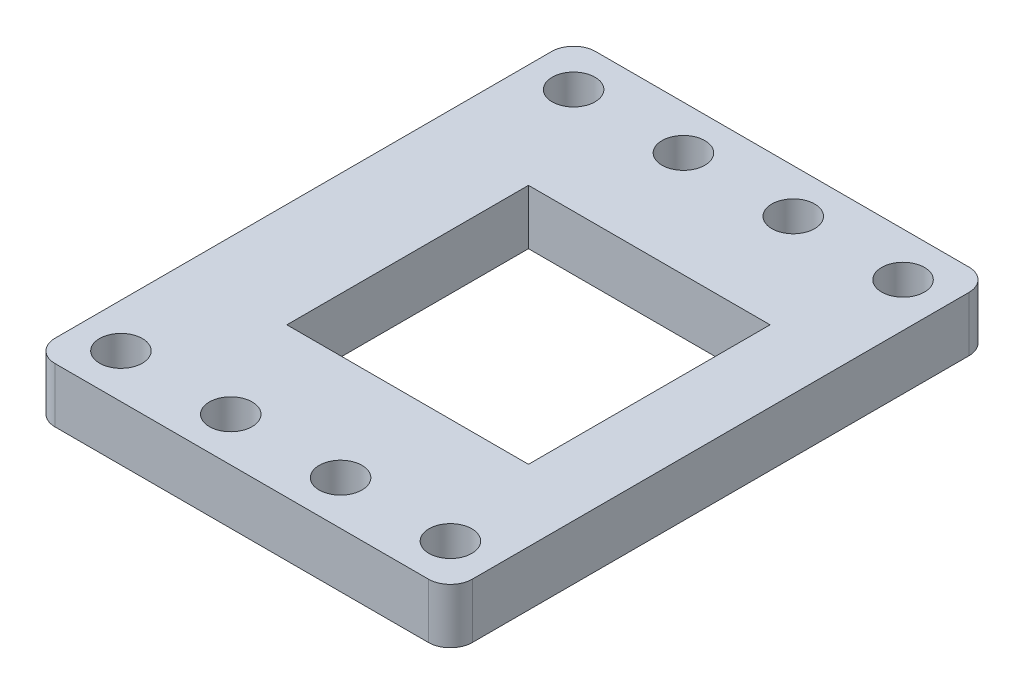
ISO-10303-21;
HEADER;
FILE_DESCRIPTION(('STEP AP214'),'2;1');
FILE_NAME('part.step','',(''),(''),'','','');
FILE_SCHEMA(('AUTOMOTIVE_DESIGN { 1 0 10303 214 1 1 1 1 }'));
ENDSEC;
DATA;
#1=APPLICATION_CONTEXT('core data for automotive mechanical design processes');
#2=APPLICATION_PROTOCOL_DEFINITION('international standard','automotive_design',2000,#1);
#3=PRODUCT_CONTEXT('',#1,'mechanical');
#4=PRODUCT('Part','Part','',(#3));
#5=PRODUCT_RELATED_PRODUCT_CATEGORY('part','',(#4));
#6=PRODUCT_DEFINITION_FORMATION('','',#4);
#7=PRODUCT_DEFINITION_CONTEXT('part definition',#1,'design');
#8=PRODUCT_DEFINITION('design','',#6,#7);
#9=PRODUCT_DEFINITION_SHAPE('','',#8);
#10=(LENGTH_UNIT() NAMED_UNIT(*) SI_UNIT(.MILLI.,.METRE.));
#11=(NAMED_UNIT(*) PLANE_ANGLE_UNIT() SI_UNIT($,.RADIAN.));
#12=(NAMED_UNIT(*) SI_UNIT($,.STERADIAN.) SOLID_ANGLE_UNIT());
#13=UNCERTAINTY_MEASURE_WITH_UNIT(LENGTH_MEASURE(1.E-05),#10,'distance_accuracy_value','');
#14=(GEOMETRIC_REPRESENTATION_CONTEXT(3) GLOBAL_UNCERTAINTY_ASSIGNED_CONTEXT((#13)) GLOBAL_UNIT_ASSIGNED_CONTEXT((#10,
#11,#12)) REPRESENTATION_CONTEXT('',''));
#15=CARTESIAN_POINT('',(0.,0.,0.));
#16=DIRECTION('',(0.,0.,1.));
#17=DIRECTION('',(1.,0.,0.));
#18=AXIS2_PLACEMENT_3D('',#15,#16,#17);
#19=CARTESIAN_POINT('',(-1.99999999999999,5.,47.22));
#20=DIRECTION('',(0.,-1.,0.));
#21=DIRECTION('',(0.,0.,-1.));
#22=AXIS2_PLACEMENT_3D('',#19,#20,#21);
#23=CYLINDRICAL_SURFACE('',#22,2.);
#24=CARTESIAN_POINT('',(-1.99999999999999,0.,47.22));
#25=DIRECTION('',(0.,1.,0.));
#26=DIRECTION('',(0.,0.,1.));
#27=AXIS2_PLACEMENT_3D('',#24,#25,#26);
#28=CIRCLE('',#27,2.);
#29=CARTESIAN_POINT('',(-1.99999999999999,0.,49.22));
#30=VERTEX_POINT('',#29);
#31=CARTESIAN_POINT('',(0.,0.,47.22));
#32=VERTEX_POINT('',#31);
#33=EDGE_CURVE('E201',#30,#32,#28,.T.);
#34=ORIENTED_EDGE('',*,*,#33,.T.);
#35=DIRECTION('',(0.,-1.,0.));
#36=VECTOR('',#35,1.);
#37=CARTESIAN_POINT('',(0.,5.,47.22));
#38=LINE('',#37,#36);
#39=CARTESIAN_POINT('',(0.,5.,47.22));
#40=VERTEX_POINT('',#39);
#41=EDGE_CURVE('E11',#40,#32,#38,.T.);
#42=ORIENTED_EDGE('',*,*,#41,.F.);
#43=CARTESIAN_POINT('',(-1.99999999999999,5.,47.22));
#44=DIRECTION('',(0.,1.,0.));
#45=DIRECTION('',(0.,0.,1.));
#46=AXIS2_PLACEMENT_3D('',#43,#44,#45);
#47=CIRCLE('',#46,2.);
#48=CARTESIAN_POINT('',(-1.99999999999999,5.,49.22));
#49=VERTEX_POINT('',#48);
#50=EDGE_CURVE('E204',#49,#40,#47,.T.);
#51=ORIENTED_EDGE('',*,*,#50,.F.);
#52=DIRECTION('',(0.,-1.,0.));
#53=VECTOR('',#52,1.);
#54=CARTESIAN_POINT('',(-1.99999999999999,5.,49.22));
#55=LINE('',#54,#53);
#56=EDGE_CURVE('E222',#49,#30,#55,.T.);
#57=ORIENTED_EDGE('',*,*,#56,.T.);
#58=EDGE_LOOP('',(#34,#42,#51,#57));
#59=FACE_BOUND('',#58,.T.);
#60=ADVANCED_FACE('F33',(#59),#23,.T.);
#61=CARTESIAN_POINT('',(0.,5.,2.));
#62=DIRECTION('',(-1.,0.,0.));
#63=DIRECTION('',(0.,0.,1.));
#64=AXIS2_PLACEMENT_3D('',#61,#62,#63);
#65=PLANE('',#64);
#66=DIRECTION('',(0.,0.,-1.));
#67=VECTOR('',#66,1.);
#68=CARTESIAN_POINT('',(0.,0.,2.));
#69=LINE('',#68,#67);
#70=CARTESIAN_POINT('',(0.,0.,2.));
#71=VERTEX_POINT('',#70);
#72=EDGE_CURVE('E225',#32,#71,#69,.T.);
#73=ORIENTED_EDGE('',*,*,#72,.T.);
#74=DIRECTION('',(0.,-1.,0.));
#75=VECTOR('',#74,1.);
#76=CARTESIAN_POINT('',(0.,5.,2.));
#77=LINE('',#76,#75);
#78=CARTESIAN_POINT('',(0.,5.,2.));
#79=VERTEX_POINT('',#78);
#80=EDGE_CURVE('E40',#79,#71,#77,.T.);
#81=ORIENTED_EDGE('',*,*,#80,.F.);
#82=DIRECTION('',(0.,0.,-1.));
#83=VECTOR('',#82,1.);
#84=CARTESIAN_POINT('',(0.,5.,2.));
#85=LINE('',#84,#83);
#86=EDGE_CURVE('E207',#40,#79,#85,.T.);
#87=ORIENTED_EDGE('',*,*,#86,.F.);
#88=ORIENTED_EDGE('',*,*,#41,.T.);
#89=EDGE_LOOP('',(#73,#81,#87,#88));
#90=FACE_BOUND('',#89,.T.);
#91=ADVANCED_FACE('F281',(#90),#65,.F.);
#92=CARTESIAN_POINT('',(-2.,5.,2.));
#93=DIRECTION('',(0.,-1.,0.));
#94=DIRECTION('',(0.,0.,-1.));
#95=AXIS2_PLACEMENT_3D('',#92,#93,#94);
#96=CYLINDRICAL_SURFACE('',#95,2.);
#97=CARTESIAN_POINT('',(-2.,0.,2.));
#98=DIRECTION('',(0.,1.,0.));
#99=DIRECTION('',(0.,0.,-1.));
#100=AXIS2_PLACEMENT_3D('',#97,#98,#99);
#101=CIRCLE('',#100,2.);
#102=CARTESIAN_POINT('',(-2.,0.,0.));
#103=VERTEX_POINT('',#102);
#104=EDGE_CURVE('E227',#71,#103,#101,.T.);
#105=ORIENTED_EDGE('',*,*,#104,.T.);
#106=DIRECTION('',(0.,-1.,0.));
#107=VECTOR('',#106,1.);
#108=CARTESIAN_POINT('',(-2.,5.,0.));
#109=LINE('',#108,#107);
#110=CARTESIAN_POINT('',(-2.,5.,0.));
#111=VERTEX_POINT('',#110);
#112=EDGE_CURVE('E252',#111,#103,#109,.T.);
#113=ORIENTED_EDGE('',*,*,#112,.F.);
#114=CARTESIAN_POINT('',(-2.,5.,2.));
#115=DIRECTION('',(0.,1.,0.));
#116=DIRECTION('',(0.,0.,-1.));
#117=AXIS2_PLACEMENT_3D('',#114,#115,#116);
#118=CIRCLE('',#117,2.);
#119=EDGE_CURVE('E210',#79,#111,#118,.T.);
#120=ORIENTED_EDGE('',*,*,#119,.F.);
#121=ORIENTED_EDGE('',*,*,#80,.T.);
#122=EDGE_LOOP('',(#105,#113,#120,#121));
#123=FACE_BOUND('',#122,.T.);
#124=ADVANCED_FACE('F259',(#123),#96,.T.);
#125=CARTESIAN_POINT('',(-36.,5.,0.));
#126=DIRECTION('',(0.,0.,1.));
#127=DIRECTION('',(1.,0.,0.));
#128=AXIS2_PLACEMENT_3D('',#125,#126,#127);
#129=PLANE('',#128);
#130=DIRECTION('',(-1.,0.,0.));
#131=VECTOR('',#130,1.);
#132=CARTESIAN_POINT('',(-36.,0.,0.));
#133=LINE('',#132,#131);
#134=CARTESIAN_POINT('',(-36.,0.,0.));
#135=VERTEX_POINT('',#134);
#136=EDGE_CURVE('E229',#103,#135,#133,.T.);
#137=ORIENTED_EDGE('',*,*,#136,.T.);
#138=DIRECTION('',(0.,-1.,0.));
#139=VECTOR('',#138,1.);
#140=CARTESIAN_POINT('',(-36.,5.,0.));
#141=LINE('',#140,#139);
#142=CARTESIAN_POINT('',(-36.,5.,0.));
#143=VERTEX_POINT('',#142);
#144=EDGE_CURVE('E249',#143,#135,#141,.T.);
#145=ORIENTED_EDGE('',*,*,#144,.F.);
#146=DIRECTION('',(-1.,0.,0.));
#147=VECTOR('',#146,1.);
#148=CARTESIAN_POINT('',(-36.,5.,0.));
#149=LINE('',#148,#147);
#150=EDGE_CURVE('E212',#111,#143,#149,.T.);
#151=ORIENTED_EDGE('',*,*,#150,.F.);
#152=ORIENTED_EDGE('',*,*,#112,.T.);
#153=EDGE_LOOP('',(#137,#145,#151,#152));
#154=FACE_BOUND('',#153,.T.);
#155=ADVANCED_FACE('F269',(#154),#129,.F.);
#156=CARTESIAN_POINT('',(-36.,5.,2.));
#157=DIRECTION('',(0.,-1.,0.));
#158=DIRECTION('',(0.,0.,-1.));
#159=AXIS2_PLACEMENT_3D('',#156,#157,#158);
#160=CYLINDRICAL_SURFACE('',#159,2.);
#161=CARTESIAN_POINT('',(-36.,0.,2.));
#162=DIRECTION('',(0.,1.,0.));
#163=DIRECTION('',(0.,0.,1.));
#164=AXIS2_PLACEMENT_3D('',#161,#162,#163);
#165=CIRCLE('',#164,2.);
#166=CARTESIAN_POINT('',(-38.,0.,2.));
#167=VERTEX_POINT('',#166);
#168=EDGE_CURVE('E231',#135,#167,#165,.T.);
#169=ORIENTED_EDGE('',*,*,#168,.T.);
#170=DIRECTION('',(0.,-1.,0.));
#171=VECTOR('',#170,1.);
#172=CARTESIAN_POINT('',(-38.,5.,2.));
#173=LINE('',#172,#171);
#174=CARTESIAN_POINT('',(-38.,5.,2.));
#175=VERTEX_POINT('',#174);
#176=EDGE_CURVE('E246',#175,#167,#173,.T.);
#177=ORIENTED_EDGE('',*,*,#176,.F.);
#178=CARTESIAN_POINT('',(-36.,5.,2.));
#179=DIRECTION('',(0.,1.,0.));
#180=DIRECTION('',(0.,0.,1.));
#181=AXIS2_PLACEMENT_3D('',#178,#179,#180);
#182=CIRCLE('',#181,2.);
#183=EDGE_CURVE('E214',#143,#175,#182,.T.);
#184=ORIENTED_EDGE('',*,*,#183,.F.);
#185=ORIENTED_EDGE('',*,*,#144,.T.);
#186=EDGE_LOOP('',(#169,#177,#184,#185));
#187=FACE_BOUND('',#186,.T.);
#188=ADVANCED_FACE('F273',(#187),#160,.T.);
#189=CARTESIAN_POINT('',(-38.,5.,2.));
#190=DIRECTION('',(1.,0.,0.));
#191=DIRECTION('',(0.,0.,-1.));
#192=AXIS2_PLACEMENT_3D('',#189,#190,#191);
#193=PLANE('',#192);
#194=DIRECTION('',(0.,0.,1.));
#195=VECTOR('',#194,1.);
#196=CARTESIAN_POINT('',(-38.,0.,2.));
#197=LINE('',#196,#195);
#198=CARTESIAN_POINT('',(-38.,0.,47.22));
#199=VERTEX_POINT('',#198);
#200=EDGE_CURVE('E233',#167,#199,#197,.T.);
#201=ORIENTED_EDGE('',*,*,#200,.T.);
#202=DIRECTION('',(0.,-1.,0.));
#203=VECTOR('',#202,1.);
#204=CARTESIAN_POINT('',(-38.,5.,47.22));
#205=LINE('',#204,#203);
#206=CARTESIAN_POINT('',(-38.,5.,47.22));
#207=VERTEX_POINT('',#206);
#208=EDGE_CURVE('E243',#207,#199,#205,.T.);
#209=ORIENTED_EDGE('',*,*,#208,.F.);
#210=DIRECTION('',(0.,0.,1.));
#211=VECTOR('',#210,1.);
#212=CARTESIAN_POINT('',(-38.,5.,2.));
#213=LINE('',#212,#211);
#214=EDGE_CURVE('E216',#175,#207,#213,.T.);
#215=ORIENTED_EDGE('',*,*,#214,.F.);
#216=ORIENTED_EDGE('',*,*,#176,.T.);
#217=EDGE_LOOP('',(#201,#209,#215,#216));
#218=FACE_BOUND('',#217,.T.);
#219=ADVANCED_FACE('F294',(#218),#193,.F.);
#220=CARTESIAN_POINT('',(-36.,5.,47.22));
#221=DIRECTION('',(0.,-1.,0.));
#222=DIRECTION('',(0.,0.,-1.));
#223=AXIS2_PLACEMENT_3D('',#220,#221,#222);
#224=CYLINDRICAL_SURFACE('',#223,2.);
#225=CARTESIAN_POINT('',(-36.,0.,47.22));
#226=DIRECTION('',(0.,1.,0.));
#227=DIRECTION('',(0.,0.,1.));
#228=AXIS2_PLACEMENT_3D('',#225,#226,#227);
#229=CIRCLE('',#228,2.);
#230=CARTESIAN_POINT('',(-36.,0.,49.22));
#231=VERTEX_POINT('',#230);
#232=EDGE_CURVE('E235',#199,#231,#229,.T.);
#233=ORIENTED_EDGE('',*,*,#232,.T.);
#234=DIRECTION('',(0.,-1.,0.));
#235=VECTOR('',#234,1.);
#236=CARTESIAN_POINT('',(-36.,5.,49.22));
#237=LINE('',#236,#235);
#238=CARTESIAN_POINT('',(-36.,5.,49.22));
#239=VERTEX_POINT('',#238);
#240=EDGE_CURVE('E240',#239,#231,#237,.T.);
#241=ORIENTED_EDGE('',*,*,#240,.F.);
#242=CARTESIAN_POINT('',(-36.,5.,47.22));
#243=DIRECTION('',(0.,1.,0.));
#244=DIRECTION('',(0.,0.,1.));
#245=AXIS2_PLACEMENT_3D('',#242,#243,#244);
#246=CIRCLE('',#245,2.);
#247=EDGE_CURVE('E218',#207,#239,#246,.T.);
#248=ORIENTED_EDGE('',*,*,#247,.F.);
#249=ORIENTED_EDGE('',*,*,#208,.T.);
#250=EDGE_LOOP('',(#233,#241,#248,#249));
#251=FACE_BOUND('',#250,.T.);
#252=ADVANCED_FACE('F292',(#251),#224,.T.);
#253=CARTESIAN_POINT('',(-36.,5.,49.22));
#254=DIRECTION('',(0.,0.,-1.));
#255=DIRECTION('',(-1.,0.,0.));
#256=AXIS2_PLACEMENT_3D('',#253,#254,#255);
#257=PLANE('',#256);
#258=DIRECTION('',(1.,0.,0.));
#259=VECTOR('',#258,1.);
#260=CARTESIAN_POINT('',(-36.,0.,49.22));
#261=LINE('',#260,#259);
#262=EDGE_CURVE('E208',#231,#30,#261,.T.);
#263=ORIENTED_EDGE('',*,*,#262,.T.);
#264=ORIENTED_EDGE('',*,*,#56,.F.);
#265=DIRECTION('',(1.,0.,0.));
#266=VECTOR('',#265,1.);
#267=CARTESIAN_POINT('',(-36.,5.,49.22));
#268=LINE('',#267,#266);
#269=EDGE_CURVE('E220',#239,#49,#268,.T.);
#270=ORIENTED_EDGE('',*,*,#269,.F.);
#271=ORIENTED_EDGE('',*,*,#240,.T.);
#272=EDGE_LOOP('',(#263,#264,#270,#271));
#273=FACE_BOUND('',#272,.T.);
#274=ADVANCED_FACE('F287',(#273),#257,.F.);
#275=CARTESIAN_POINT('',(-1.99999999999999,5.,47.22));
#276=DIRECTION('',(0.,1.,0.));
#277=DIRECTION('',(0.,0.,1.));
#278=AXIS2_PLACEMENT_3D('',#275,#276,#277);
#279=PLANE('',#278);
#280=CARTESIAN_POINT('',(-34.,5.,4.));
#281=DIRECTION('',(0.,1.,0.));
#282=DIRECTION('',(0.,0.,1.));
#283=AXIS2_PLACEMENT_3D('',#280,#281,#282);
#284=CIRCLE('',#283,1.95);
#285=CARTESIAN_POINT('',(-34.,5.,5.95));
#286=VERTEX_POINT('',#285);
#287=EDGE_CURVE('E177',#286,#286,#284,.T.);
#288=ORIENTED_EDGE('',*,*,#287,.F.);
#289=EDGE_LOOP('',(#288));
#290=FACE_BOUND('',#289,.T.);
#291=CARTESIAN_POINT('',(-34.,5.,45.22));
#292=DIRECTION('',(0.,1.,0.));
#293=DIRECTION('',(0.,0.,-1.));
#294=AXIS2_PLACEMENT_3D('',#291,#292,#293);
#295=CIRCLE('',#294,1.95);
#296=CARTESIAN_POINT('',(-34.,5.,43.27));
#297=VERTEX_POINT('',#296);
#298=EDGE_CURVE('E163',#297,#297,#295,.T.);
#299=ORIENTED_EDGE('',*,*,#298,.F.);
#300=EDGE_LOOP('',(#299));
#301=FACE_BOUND('',#300,.T.);
#302=CARTESIAN_POINT('',(-24.,5.,4.));
#303=DIRECTION('',(0.,1.,0.));
#304=DIRECTION('',(0.,0.,1.));
#305=AXIS2_PLACEMENT_3D('',#302,#303,#304);
#306=CIRCLE('',#305,1.95);
#307=CARTESIAN_POINT('',(-24.,5.,5.95));
#308=VERTEX_POINT('',#307);
#309=EDGE_CURVE('E183',#308,#308,#306,.T.);
#310=ORIENTED_EDGE('',*,*,#309,.F.);
#311=EDGE_LOOP('',(#310));
#312=FACE_BOUND('',#311,.T.);
#313=CARTESIAN_POINT('',(-14.,5.,4.));
#314=DIRECTION('',(0.,1.,0.));
#315=DIRECTION('',(0.,0.,1.));
#316=AXIS2_PLACEMENT_3D('',#313,#314,#315);
#317=CIRCLE('',#316,1.95);
#318=CARTESIAN_POINT('',(-14.,5.,5.94999999999999));
#319=VERTEX_POINT('',#318);
#320=EDGE_CURVE('E190',#319,#319,#317,.T.);
#321=ORIENTED_EDGE('',*,*,#320,.F.);
#322=EDGE_LOOP('',(#321));
#323=FACE_BOUND('',#322,.T.);
#324=DIRECTION('',(0.,0.,1.));
#325=VECTOR('',#324,1.);
#326=CARTESIAN_POINT('',(-28.5,5.,13.61));
#327=LINE('',#326,#325);
#328=CARTESIAN_POINT('',(-28.5,5.,13.61));
#329=VERTEX_POINT('',#328);
#330=CARTESIAN_POINT('',(-28.5,5.,35.61));
#331=VERTEX_POINT('',#330);
#332=EDGE_CURVE('E47',#329,#331,#327,.T.);
#333=ORIENTED_EDGE('',*,*,#332,.F.);
#334=DIRECTION('',(-1.,0.,0.));
#335=VECTOR('',#334,1.);
#336=CARTESIAN_POINT('',(-28.5,5.,13.61));
#337=LINE('',#336,#335);
#338=CARTESIAN_POINT('',(-6.49999999999999,5.,13.61));
#339=VERTEX_POINT('',#338);
#340=EDGE_CURVE('E139',#339,#329,#337,.T.);
#341=ORIENTED_EDGE('',*,*,#340,.F.);
#342=DIRECTION('',(0.,0.,-1.));
#343=VECTOR('',#342,1.);
#344=CARTESIAN_POINT('',(-6.49999999999999,5.,13.61));
#345=LINE('',#344,#343);
#346=CARTESIAN_POINT('',(-6.49999999999999,5.,35.61));
#347=VERTEX_POINT('',#346);
#348=EDGE_CURVE('E142',#347,#339,#345,.T.);
#349=ORIENTED_EDGE('',*,*,#348,.F.);
#350=DIRECTION('',(1.,0.,0.));
#351=VECTOR('',#350,1.);
#352=CARTESIAN_POINT('',(-28.5,5.,35.61));
#353=LINE('',#352,#351);
#354=EDGE_CURVE('E151',#331,#347,#353,.T.);
#355=ORIENTED_EDGE('',*,*,#354,.F.);
#356=EDGE_LOOP('',(#333,#341,#349,#355));
#357=FACE_BOUND('',#356,.T.);
#358=CARTESIAN_POINT('',(-4.,5.,45.22));
#359=DIRECTION('',(0.,1.,0.));
#360=DIRECTION('',(0.,0.,-1.));
#361=AXIS2_PLACEMENT_3D('',#358,#359,#360);
#362=CIRCLE('',#361,1.95);
#363=CARTESIAN_POINT('',(-4.,5.,43.27));
#364=VERTEX_POINT('',#363);
#365=EDGE_CURVE('E145',#364,#364,#362,.T.);
#366=ORIENTED_EDGE('',*,*,#365,.F.);
#367=EDGE_LOOP('',(#366));
#368=FACE_BOUND('',#367,.T.);
#369=CARTESIAN_POINT('',(-14.,5.,45.22));
#370=DIRECTION('',(0.,1.,0.));
#371=DIRECTION('',(0.,0.,-1.));
#372=AXIS2_PLACEMENT_3D('',#369,#370,#371);
#373=CIRCLE('',#372,1.95);
#374=CARTESIAN_POINT('',(-14.,5.,43.27));
#375=VERTEX_POINT('',#374);
#376=EDGE_CURVE('E170',#375,#375,#373,.T.);
#377=ORIENTED_EDGE('',*,*,#376,.F.);
#378=EDGE_LOOP('',(#377));
#379=FACE_BOUND('',#378,.T.);
#380=CARTESIAN_POINT('',(-24.,5.,45.22));
#381=DIRECTION('',(0.,1.,0.));
#382=DIRECTION('',(0.,0.,-1.));
#383=AXIS2_PLACEMENT_3D('',#380,#381,#382);
#384=CIRCLE('',#383,1.95);
#385=CARTESIAN_POINT('',(-24.,5.,43.27));
#386=VERTEX_POINT('',#385);
#387=EDGE_CURVE('E164',#386,#386,#384,.T.);
#388=ORIENTED_EDGE('',*,*,#387,.F.);
#389=EDGE_LOOP('',(#388));
#390=FACE_BOUND('',#389,.T.);
#391=CARTESIAN_POINT('',(-4.,5.,4.));
#392=DIRECTION('',(0.,1.,0.));
#393=DIRECTION('',(0.,0.,1.));
#394=AXIS2_PLACEMENT_3D('',#391,#392,#393);
#395=CIRCLE('',#394,1.95);
#396=CARTESIAN_POINT('',(-4.,5.,5.94999999999999));
#397=VERTEX_POINT('',#396);
#398=EDGE_CURVE('E189',#397,#397,#395,.T.);
#399=ORIENTED_EDGE('',*,*,#398,.F.);
#400=EDGE_LOOP('',(#399));
#401=FACE_BOUND('',#400,.T.);
#402=ORIENTED_EDGE('',*,*,#50,.T.);
#403=ORIENTED_EDGE('',*,*,#86,.T.);
#404=ORIENTED_EDGE('',*,*,#119,.T.);
#405=ORIENTED_EDGE('',*,*,#150,.T.);
#406=ORIENTED_EDGE('',*,*,#183,.T.);
#407=ORIENTED_EDGE('',*,*,#214,.T.);
#408=ORIENTED_EDGE('',*,*,#247,.T.);
#409=ORIENTED_EDGE('',*,*,#269,.T.);
#410=EDGE_LOOP('',(#402,#403,#404,#405,#406,#407,#408,#409));
#411=FACE_BOUND('',#410,.T.);
#412=ADVANCED_FACE('F277',(#290,#301,#312,#323,#357,#368,#379,#390,#401,#411),#279,.T.);
#413=CARTESIAN_POINT('',(-1.99999999999999,0.,47.22));
#414=DIRECTION('',(0.,1.,0.));
#415=DIRECTION('',(0.,0.,1.));
#416=AXIS2_PLACEMENT_3D('',#413,#414,#415);
#417=PLANE('',#416);
#418=CARTESIAN_POINT('',(-34.,0.,4.));
#419=DIRECTION('',(0.,1.,0.));
#420=DIRECTION('',(0.,0.,1.));
#421=AXIS2_PLACEMENT_3D('',#418,#419,#420);
#422=CIRCLE('',#421,1.95);
#423=CARTESIAN_POINT('',(-34.,0.,5.95));
#424=VERTEX_POINT('',#423);
#425=EDGE_CURVE('E180',#424,#424,#422,.T.);
#426=ORIENTED_EDGE('',*,*,#425,.T.);
#427=EDGE_LOOP('',(#426));
#428=FACE_BOUND('',#427,.T.);
#429=CARTESIAN_POINT('',(-34.,0.,45.22));
#430=DIRECTION('',(0.,1.,0.));
#431=DIRECTION('',(0.,0.,-1.));
#432=AXIS2_PLACEMENT_3D('',#429,#430,#431);
#433=CIRCLE('',#432,1.95);
#434=CARTESIAN_POINT('',(-34.,0.,43.27));
#435=VERTEX_POINT('',#434);
#436=EDGE_CURVE('E174',#435,#435,#433,.T.);
#437=ORIENTED_EDGE('',*,*,#436,.T.);
#438=EDGE_LOOP('',(#437));
#439=FACE_BOUND('',#438,.T.);
#440=CARTESIAN_POINT('',(-24.,0.,4.));
#441=DIRECTION('',(0.,1.,0.));
#442=DIRECTION('',(0.,0.,1.));
#443=AXIS2_PLACEMENT_3D('',#440,#441,#442);
#444=CIRCLE('',#443,1.95);
#445=CARTESIAN_POINT('',(-24.,0.,5.95));
#446=VERTEX_POINT('',#445);
#447=EDGE_CURVE('E193',#446,#446,#444,.T.);
#448=ORIENTED_EDGE('',*,*,#447,.T.);
#449=EDGE_LOOP('',(#448));
#450=FACE_BOUND('',#449,.T.);
#451=CARTESIAN_POINT('',(-14.,0.,4.));
#452=DIRECTION('',(0.,1.,0.));
#453=DIRECTION('',(0.,0.,1.));
#454=AXIS2_PLACEMENT_3D('',#451,#452,#453);
#455=CIRCLE('',#454,1.95);
#456=CARTESIAN_POINT('',(-14.,0.,5.94999999999999));
#457=VERTEX_POINT('',#456);
#458=EDGE_CURVE('E186',#457,#457,#455,.T.);
#459=ORIENTED_EDGE('',*,*,#458,.T.);
#460=EDGE_LOOP('',(#459));
#461=FACE_BOUND('',#460,.T.);
#462=DIRECTION('',(-1.,0.,0.));
#463=VECTOR('',#462,1.);
#464=CARTESIAN_POINT('',(-28.5,0.,13.61));
#465=LINE('',#464,#463);
#466=CARTESIAN_POINT('',(-6.49999999999999,0.,13.61));
#467=VERTEX_POINT('',#466);
#468=CARTESIAN_POINT('',(-28.5,0.,13.61));
#469=VERTEX_POINT('',#468);
#470=EDGE_CURVE('E129',#467,#469,#465,.T.);
#471=ORIENTED_EDGE('',*,*,#470,.T.);
#472=DIRECTION('',(0.,0.,1.));
#473=VECTOR('',#472,1.);
#474=CARTESIAN_POINT('',(-28.5,0.,13.61));
#475=LINE('',#474,#473);
#476=CARTESIAN_POINT('',(-28.5,0.,35.61));
#477=VERTEX_POINT('',#476);
#478=EDGE_CURVE('E123',#469,#477,#475,.T.);
#479=ORIENTED_EDGE('',*,*,#478,.T.);
#480=DIRECTION('',(1.,0.,0.));
#481=VECTOR('',#480,1.);
#482=CARTESIAN_POINT('',(-28.5,0.,35.61));
#483=LINE('',#482,#481);
#484=CARTESIAN_POINT('',(-6.49999999999999,0.,35.61));
#485=VERTEX_POINT('',#484);
#486=EDGE_CURVE('E132',#477,#485,#483,.T.);
#487=ORIENTED_EDGE('',*,*,#486,.T.);
#488=DIRECTION('',(0.,0.,-1.));
#489=VECTOR('',#488,1.);
#490=CARTESIAN_POINT('',(-6.49999999999999,0.,13.61));
#491=LINE('',#490,#489);
#492=EDGE_CURVE('E55',#485,#467,#491,.T.);
#493=ORIENTED_EDGE('',*,*,#492,.T.);
#494=EDGE_LOOP('',(#471,#479,#487,#493));
#495=FACE_BOUND('',#494,.T.);
#496=CARTESIAN_POINT('',(-4.,0.,45.22));
#497=DIRECTION('',(0.,1.,0.));
#498=DIRECTION('',(0.,0.,-1.));
#499=AXIS2_PLACEMENT_3D('',#496,#497,#498);
#500=CIRCLE('',#499,1.95);
#501=CARTESIAN_POINT('',(-4.,0.,43.27));
#502=VERTEX_POINT('',#501);
#503=EDGE_CURVE('E173',#502,#502,#500,.T.);
#504=ORIENTED_EDGE('',*,*,#503,.T.);
#505=EDGE_LOOP('',(#504));
#506=FACE_BOUND('',#505,.T.);
#507=CARTESIAN_POINT('',(-14.,0.,45.22));
#508=DIRECTION('',(0.,1.,0.));
#509=DIRECTION('',(0.,0.,-1.));
#510=AXIS2_PLACEMENT_3D('',#507,#508,#509);
#511=CIRCLE('',#510,1.95);
#512=CARTESIAN_POINT('',(-14.,0.,43.27));
#513=VERTEX_POINT('',#512);
#514=EDGE_CURVE('E167',#513,#513,#511,.T.);
#515=ORIENTED_EDGE('',*,*,#514,.T.);
#516=EDGE_LOOP('',(#515));
#517=FACE_BOUND('',#516,.T.);
#518=CARTESIAN_POINT('',(-24.,0.,45.22));
#519=DIRECTION('',(0.,1.,0.));
#520=DIRECTION('',(0.,0.,-1.));
#521=AXIS2_PLACEMENT_3D('',#518,#519,#520);
#522=CIRCLE('',#521,1.95);
#523=CARTESIAN_POINT('',(-24.,0.,43.27));
#524=VERTEX_POINT('',#523);
#525=EDGE_CURVE('E160',#524,#524,#522,.T.);
#526=ORIENTED_EDGE('',*,*,#525,.T.);
#527=EDGE_LOOP('',(#526));
#528=FACE_BOUND('',#527,.T.);
#529=CARTESIAN_POINT('',(-4.,0.,4.));
#530=DIRECTION('',(0.,1.,0.));
#531=DIRECTION('',(0.,0.,1.));
#532=AXIS2_PLACEMENT_3D('',#529,#530,#531);
#533=CIRCLE('',#532,1.95);
#534=CARTESIAN_POINT('',(-4.,0.,5.94999999999999));
#535=VERTEX_POINT('',#534);
#536=EDGE_CURVE('E198',#535,#535,#533,.T.);
#537=ORIENTED_EDGE('',*,*,#536,.T.);
#538=EDGE_LOOP('',(#537));
#539=FACE_BOUND('',#538,.T.);
#540=ORIENTED_EDGE('',*,*,#33,.F.);
#541=ORIENTED_EDGE('',*,*,#262,.F.);
#542=ORIENTED_EDGE('',*,*,#232,.F.);
#543=ORIENTED_EDGE('',*,*,#200,.F.);
#544=ORIENTED_EDGE('',*,*,#168,.F.);
#545=ORIENTED_EDGE('',*,*,#136,.F.);
#546=ORIENTED_EDGE('',*,*,#104,.F.);
#547=ORIENTED_EDGE('',*,*,#72,.F.);
#548=EDGE_LOOP('',(#540,#541,#542,#543,#544,#545,#546,#547));
#549=FACE_BOUND('',#548,.T.);
#550=ADVANCED_FACE('F136',(#428,#439,#450,#461,#495,#506,#517,#528,#539,#549),#417,.F.);
#551=CARTESIAN_POINT('',(-4.,0.,4.));
#552=DIRECTION('',(0.,1.,0.));
#553=DIRECTION('',(0.,0.,1.));
#554=AXIS2_PLACEMENT_3D('',#551,#552,#553);
#555=CYLINDRICAL_SURFACE('',#554,1.95);
#556=ORIENTED_EDGE('',*,*,#536,.F.);
#557=EDGE_LOOP('',(#556));
#558=FACE_BOUND('',#557,.T.);
#559=ORIENTED_EDGE('',*,*,#398,.T.);
#560=EDGE_LOOP('',(#559));
#561=FACE_BOUND('',#560,.T.);
#562=ADVANCED_FACE('F357',(#558,#561),#555,.F.);
#563=CARTESIAN_POINT('',(-24.,0.,45.22));
#564=DIRECTION('',(0.,1.,0.));
#565=DIRECTION('',(0.,0.,1.));
#566=AXIS2_PLACEMENT_3D('',#563,#564,#565);
#567=CYLINDRICAL_SURFACE('',#566,1.95);
#568=ORIENTED_EDGE('',*,*,#525,.F.);
#569=EDGE_LOOP('',(#568));
#570=FACE_BOUND('',#569,.T.);
#571=ORIENTED_EDGE('',*,*,#387,.T.);
#572=EDGE_LOOP('',(#571));
#573=FACE_BOUND('',#572,.T.);
#574=ADVANCED_FACE('F367',(#570,#573),#567,.F.);
#575=CARTESIAN_POINT('',(-14.,0.,45.22));
#576=DIRECTION('',(0.,1.,0.));
#577=DIRECTION('',(0.,0.,1.));
#578=AXIS2_PLACEMENT_3D('',#575,#576,#577);
#579=CYLINDRICAL_SURFACE('',#578,1.95);
#580=ORIENTED_EDGE('',*,*,#514,.F.);
#581=EDGE_LOOP('',(#580));
#582=FACE_BOUND('',#581,.T.);
#583=ORIENTED_EDGE('',*,*,#376,.T.);
#584=EDGE_LOOP('',(#583));
#585=FACE_BOUND('',#584,.T.);
#586=ADVANCED_FACE('F377',(#582,#585),#579,.F.);
#587=CARTESIAN_POINT('',(-4.,0.,45.22));
#588=DIRECTION('',(0.,1.,0.));
#589=DIRECTION('',(0.,0.,1.));
#590=AXIS2_PLACEMENT_3D('',#587,#588,#589);
#591=CYLINDRICAL_SURFACE('',#590,1.95);
#592=ORIENTED_EDGE('',*,*,#503,.F.);
#593=EDGE_LOOP('',(#592));
#594=FACE_BOUND('',#593,.T.);
#595=ORIENTED_EDGE('',*,*,#365,.T.);
#596=EDGE_LOOP('',(#595));
#597=FACE_BOUND('',#596,.T.);
#598=ADVANCED_FACE('F387',(#594,#597),#591,.F.);
#599=CARTESIAN_POINT('',(-28.5,0.,13.61));
#600=DIRECTION('',(-1.,0.,0.));
#601=DIRECTION('',(0.,0.,1.));
#602=AXIS2_PLACEMENT_3D('',#599,#600,#601);
#603=PLANE('',#602);
#604=ORIENTED_EDGE('',*,*,#332,.T.);
#605=DIRECTION('',(0.,1.,0.));
#606=VECTOR('',#605,1.);
#607=CARTESIAN_POINT('',(-28.5,0.,35.61));
#608=LINE('',#607,#606);
#609=EDGE_CURVE('E119',#477,#331,#608,.T.);
#610=ORIENTED_EDGE('',*,*,#609,.F.);
#611=ORIENTED_EDGE('',*,*,#478,.F.);
#612=DIRECTION('',(0.,1.,0.));
#613=VECTOR('',#612,1.);
#614=CARTESIAN_POINT('',(-28.5,0.,13.61));
#615=LINE('',#614,#613);
#616=EDGE_CURVE('E155',#469,#329,#615,.T.);
#617=ORIENTED_EDGE('',*,*,#616,.T.);
#618=EDGE_LOOP('',(#604,#610,#611,#617));
#619=FACE_BOUND('',#618,.T.);
#620=ADVANCED_FACE('F121',(#619),#603,.F.);
#621=CARTESIAN_POINT('',(-28.5,0.,13.61));
#622=DIRECTION('',(0.,0.,-1.));
#623=DIRECTION('',(-1.,0.,0.));
#624=AXIS2_PLACEMENT_3D('',#621,#622,#623);
#625=PLANE('',#624);
#626=ORIENTED_EDGE('',*,*,#340,.T.);
#627=ORIENTED_EDGE('',*,*,#616,.F.);
#628=ORIENTED_EDGE('',*,*,#470,.F.);
#629=DIRECTION('',(0.,1.,0.));
#630=VECTOR('',#629,1.);
#631=CARTESIAN_POINT('',(-6.49999999999999,0.,13.61));
#632=LINE('',#631,#630);
#633=EDGE_CURVE('E157',#467,#339,#632,.T.);
#634=ORIENTED_EDGE('',*,*,#633,.T.);
#635=EDGE_LOOP('',(#626,#627,#628,#634));
#636=FACE_BOUND('',#635,.T.);
#637=ADVANCED_FACE('F406',(#636),#625,.F.);
#638=CARTESIAN_POINT('',(-6.49999999999999,0.,13.61));
#639=DIRECTION('',(1.,0.,0.));
#640=DIRECTION('',(0.,0.,-1.));
#641=AXIS2_PLACEMENT_3D('',#638,#639,#640);
#642=PLANE('',#641);
#643=ORIENTED_EDGE('',*,*,#348,.T.);
#644=ORIENTED_EDGE('',*,*,#633,.F.);
#645=ORIENTED_EDGE('',*,*,#492,.F.);
#646=DIRECTION('',(0.,1.,0.));
#647=VECTOR('',#646,1.);
#648=CARTESIAN_POINT('',(-6.49999999999999,0.,35.61));
#649=LINE('',#648,#647);
#650=EDGE_CURVE('E128',#485,#347,#649,.T.);
#651=ORIENTED_EDGE('',*,*,#650,.T.);
#652=EDGE_LOOP('',(#643,#644,#645,#651));
#653=FACE_BOUND('',#652,.T.);
#654=ADVANCED_FACE('F415',(#653),#642,.F.);
#655=CARTESIAN_POINT('',(-28.5,0.,35.61));
#656=DIRECTION('',(0.,0.,1.));
#657=DIRECTION('',(1.,0.,0.));
#658=AXIS2_PLACEMENT_3D('',#655,#656,#657);
#659=PLANE('',#658);
#660=ORIENTED_EDGE('',*,*,#354,.T.);
#661=ORIENTED_EDGE('',*,*,#650,.F.);
#662=ORIENTED_EDGE('',*,*,#486,.F.);
#663=ORIENTED_EDGE('',*,*,#609,.T.);
#664=EDGE_LOOP('',(#660,#661,#662,#663));
#665=FACE_BOUND('',#664,.T.);
#666=ADVANCED_FACE('F133',(#665),#659,.F.);
#667=CARTESIAN_POINT('',(-14.,0.,4.));
#668=DIRECTION('',(0.,1.,0.));
#669=DIRECTION('',(0.,0.,1.));
#670=AXIS2_PLACEMENT_3D('',#667,#668,#669);
#671=CYLINDRICAL_SURFACE('',#670,1.95);
#672=ORIENTED_EDGE('',*,*,#458,.F.);
#673=EDGE_LOOP('',(#672));
#674=FACE_BOUND('',#673,.T.);
#675=ORIENTED_EDGE('',*,*,#320,.T.);
#676=EDGE_LOOP('',(#675));
#677=FACE_BOUND('',#676,.T.);
#678=ADVANCED_FACE('F433',(#674,#677),#671,.F.);
#679=CARTESIAN_POINT('',(-24.,0.,4.));
#680=DIRECTION('',(0.,1.,0.));
#681=DIRECTION('',(0.,0.,1.));
#682=AXIS2_PLACEMENT_3D('',#679,#680,#681);
#683=CYLINDRICAL_SURFACE('',#682,1.95);
#684=ORIENTED_EDGE('',*,*,#447,.F.);
#685=EDGE_LOOP('',(#684));
#686=FACE_BOUND('',#685,.T.);
#687=ORIENTED_EDGE('',*,*,#309,.T.);
#688=EDGE_LOOP('',(#687));
#689=FACE_BOUND('',#688,.T.);
#690=ADVANCED_FACE('F442',(#686,#689),#683,.F.);
#691=CARTESIAN_POINT('',(-34.,0.,45.22));
#692=DIRECTION('',(0.,1.,0.));
#693=DIRECTION('',(0.,0.,1.));
#694=AXIS2_PLACEMENT_3D('',#691,#692,#693);
#695=CYLINDRICAL_SURFACE('',#694,1.95);
#696=ORIENTED_EDGE('',*,*,#436,.F.);
#697=EDGE_LOOP('',(#696));
#698=FACE_BOUND('',#697,.T.);
#699=ORIENTED_EDGE('',*,*,#298,.T.);
#700=EDGE_LOOP('',(#699));
#701=FACE_BOUND('',#700,.T.);
#702=ADVANCED_FACE('F452',(#698,#701),#695,.F.);
#703=CARTESIAN_POINT('',(-34.,0.,4.));
#704=DIRECTION('',(0.,1.,0.));
#705=DIRECTION('',(0.,0.,1.));
#706=AXIS2_PLACEMENT_3D('',#703,#704,#705);
#707=CYLINDRICAL_SURFACE('',#706,1.95);
#708=ORIENTED_EDGE('',*,*,#425,.F.);
#709=EDGE_LOOP('',(#708));
#710=FACE_BOUND('',#709,.T.);
#711=ORIENTED_EDGE('',*,*,#287,.T.);
#712=EDGE_LOOP('',(#711));
#713=FACE_BOUND('',#712,.T.);
#714=ADVANCED_FACE('F462',(#710,#713),#707,.F.);
#715=CLOSED_SHELL('',(#60,#91,#124,#155,#188,#219,#252,#274,#412,#550,#562,#574,#586,#598,#620,
#637,#654,#666,#678,#690,#702,#714));
#716=MANIFOLD_SOLID_BREP('B2',#715);
#717=ADVANCED_BREP_SHAPE_REPRESENTATION('',(#18,#716),#14);
#718=SHAPE_DEFINITION_REPRESENTATION(#9,#717);
ENDSEC;
END-ISO-10303-21;
